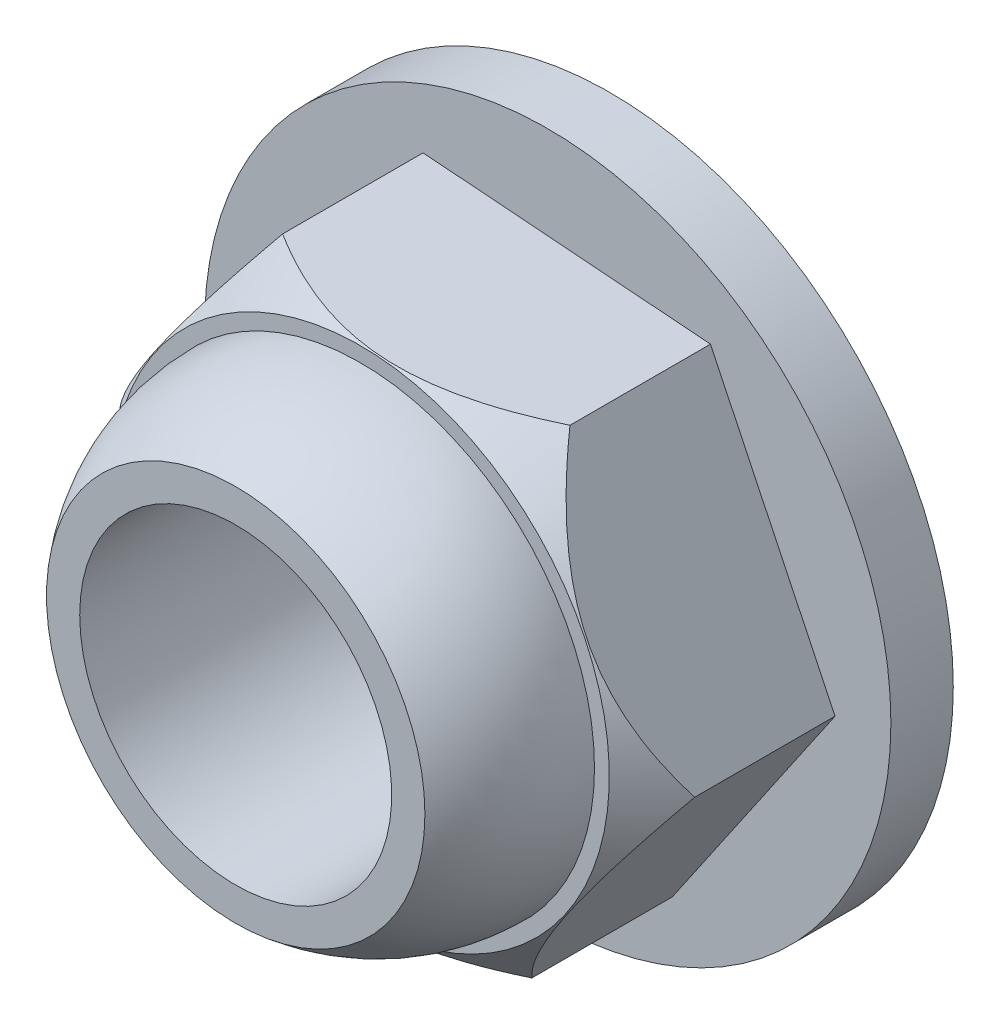
ISO-10303-21;
HEADER;
FILE_DESCRIPTION(('STEP AP214'),'2;1');
FILE_NAME('part.step','',(''),(''),'','','');
FILE_SCHEMA(('AUTOMOTIVE_DESIGN { 1 0 10303 214 1 1 1 1 }'));
ENDSEC;
DATA;
#1=APPLICATION_CONTEXT('core data for automotive mechanical design processes');
#2=APPLICATION_PROTOCOL_DEFINITION('international standard','automotive_design',2000,#1);
#3=PRODUCT_CONTEXT('',#1,'mechanical');
#4=PRODUCT('Part','Part','',(#3));
#5=PRODUCT_RELATED_PRODUCT_CATEGORY('part','',(#4));
#6=PRODUCT_DEFINITION_FORMATION('','',#4);
#7=PRODUCT_DEFINITION_CONTEXT('part definition',#1,'design');
#8=PRODUCT_DEFINITION('design','',#6,#7);
#9=PRODUCT_DEFINITION_SHAPE('','',#8);
#10=(LENGTH_UNIT() NAMED_UNIT(*) SI_UNIT(.MILLI.,.METRE.));
#11=(NAMED_UNIT(*) PLANE_ANGLE_UNIT() SI_UNIT($,.RADIAN.));
#12=(NAMED_UNIT(*) SI_UNIT($,.STERADIAN.) SOLID_ANGLE_UNIT());
#13=UNCERTAINTY_MEASURE_WITH_UNIT(LENGTH_MEASURE(1.E-05),#10,'distance_accuracy_value','');
#14=(GEOMETRIC_REPRESENTATION_CONTEXT(3) GLOBAL_UNCERTAINTY_ASSIGNED_CONTEXT((#13)) GLOBAL_UNIT_ASSIGNED_CONTEXT((#10,
#11,#12)) REPRESENTATION_CONTEXT('',''));
#15=CARTESIAN_POINT('',(0.,0.,0.));
#16=DIRECTION('',(0.,0.,1.));
#17=DIRECTION('',(1.,0.,0.));
#18=AXIS2_PLACEMENT_3D('',#15,#16,#17);
#19=CARTESIAN_POINT('',(0.,0.,1.));
#20=DIRECTION('',(0.,0.,-1.));
#21=DIRECTION('',(-1.,0.,0.));
#22=AXIS2_PLACEMENT_3D('',#19,#20,#21);
#23=CYLINDRICAL_SURFACE('',#22,5.5);
#24=CARTESIAN_POINT('',(0.,0.,1.));
#25=DIRECTION('',(0.,0.,1.));
#26=DIRECTION('',(1.,0.,0.));
#27=AXIS2_PLACEMENT_3D('',#24,#25,#26);
#28=CIRCLE('',#27,5.5);
#29=CARTESIAN_POINT('',(5.5,0.,1.));
#30=VERTEX_POINT('',#29);
#31=EDGE_CURVE('E129',#30,#30,#28,.T.);
#32=ORIENTED_EDGE('',*,*,#31,.F.);
#33=EDGE_LOOP('',(#32));
#34=FACE_BOUND('',#33,.T.);
#35=CARTESIAN_POINT('',(0.,0.,0.));
#36=DIRECTION('',(0.,0.,1.));
#37=DIRECTION('',(1.,0.,0.));
#38=AXIS2_PLACEMENT_3D('',#35,#36,#37);
#39=CIRCLE('',#38,5.5);
#40=CARTESIAN_POINT('',(5.5,0.,0.));
#41=VERTEX_POINT('',#40);
#42=EDGE_CURVE('E128',#41,#41,#39,.T.);
#43=ORIENTED_EDGE('',*,*,#42,.T.);
#44=EDGE_LOOP('',(#43));
#45=FACE_BOUND('',#44,.T.);
#46=ADVANCED_FACE('F43',(#34,#45),#23,.T.);
#47=CARTESIAN_POINT('',(0.,0.,1.));
#48=DIRECTION('',(0.,0.,1.));
#49=DIRECTION('',(1.,0.,0.));
#50=AXIS2_PLACEMENT_3D('',#47,#48,#49);
#51=PLANE('',#50);
#52=DIRECTION('',(-0.432395096374126,0.901684246636044,0.));
#53=VECTOR('',#52,1.);
#54=CARTESIAN_POINT('',(4.60531068769568,-0.352770184580956,1.));
#55=LINE('',#54,#53);
#56=CARTESIAN_POINT('',(4.60531068769568,-0.352770184580956,1.));
#57=VERTEX_POINT('',#56);
#58=CARTESIAN_POINT('',(2.60816328539267,3.81193095557396,1.));
#59=VERTEX_POINT('',#58);
#60=EDGE_CURVE('E370',#57,#59,#55,.T.);
#61=ORIENTED_EDGE('',*,*,#60,.F.);
#62=DIRECTION('',(0.564683915591984,0.825307261249836,0.));
#63=VECTOR('',#62,1.);
#64=CARTESIAN_POINT('',(1.99714740230301,-4.16470114015492,1.));
#65=LINE('',#64,#63);
#66=CARTESIAN_POINT('',(1.99714740230301,-4.16470114015492,1.));
#67=VERTEX_POINT('',#66);
#68=EDGE_CURVE('E358',#67,#57,#65,.T.);
#69=ORIENTED_EDGE('',*,*,#68,.F.);
#70=DIRECTION('',(0.99707901196611,-0.0763769853862086,0.));
#71=VECTOR('',#70,1.);
#72=CARTESIAN_POINT('',(-2.60816328539267,-3.81193095557396,1.));
#73=LINE('',#72,#71);
#74=CARTESIAN_POINT('',(-2.60816328539267,-3.81193095557396,1.));
#75=VERTEX_POINT('',#74);
#76=EDGE_CURVE('E360',#75,#67,#73,.T.);
#77=ORIENTED_EDGE('',*,*,#76,.F.);
#78=DIRECTION('',(0.432395096374126,-0.901684246636044,0.));
#79=VECTOR('',#78,1.);
#80=CARTESIAN_POINT('',(-4.60531068769568,0.352770184580956,1.));
#81=LINE('',#80,#79);
#82=CARTESIAN_POINT('',(-4.60531068769568,0.352770184580956,1.));
#83=VERTEX_POINT('',#82);
#84=EDGE_CURVE('E365',#83,#75,#81,.T.);
#85=ORIENTED_EDGE('',*,*,#84,.F.);
#86=DIRECTION('',(-0.564683915591984,-0.825307261249836,0.));
#87=VECTOR('',#86,1.);
#88=CARTESIAN_POINT('',(-1.99714740230301,4.16470114015492,1.));
#89=LINE('',#88,#87);
#90=CARTESIAN_POINT('',(-1.99714740230301,4.16470114015492,1.));
#91=VERTEX_POINT('',#90);
#92=EDGE_CURVE('E118',#91,#83,#89,.T.);
#93=ORIENTED_EDGE('',*,*,#92,.F.);
#94=DIRECTION('',(-0.99707901196611,0.0763769853862088,0.));
#95=VECTOR('',#94,1.);
#96=CARTESIAN_POINT('',(2.60816328539267,3.81193095557396,1.));
#97=LINE('',#96,#95);
#98=EDGE_CURVE('E368',#59,#91,#97,.T.);
#99=ORIENTED_EDGE('',*,*,#98,.F.);
#100=EDGE_LOOP('',(#61,#69,#77,#85,#93,#99));
#101=FACE_BOUND('',#100,.T.);
#102=ORIENTED_EDGE('',*,*,#31,.T.);
#103=EDGE_LOOP('',(#102));
#104=FACE_BOUND('',#103,.T.);
#105=ADVANCED_FACE('F210',(#101,#104),#51,.T.);
#106=CARTESIAN_POINT('',(0.,0.,0.));
#107=DIRECTION('',(0.,0.,1.));
#108=DIRECTION('',(1.,0.,0.));
#109=AXIS2_PLACEMENT_3D('',#106,#107,#108);
#110=PLANE('',#109);
#111=CARTESIAN_POINT('',(0.,0.,0.));
#112=DIRECTION('',(0.,0.,1.));
#113=DIRECTION('',(1.,0.,0.));
#114=AXIS2_PLACEMENT_3D('',#111,#112,#113);
#115=CIRCLE('',#114,2.8);
#116=CARTESIAN_POINT('',(2.8,0.,0.));
#117=VERTEX_POINT('',#116);
#118=EDGE_CURVE('E11',#117,#117,#115,.T.);
#119=ORIENTED_EDGE('',*,*,#118,.T.);
#120=EDGE_LOOP('',(#119));
#121=FACE_BOUND('',#120,.T.);
#122=ORIENTED_EDGE('',*,*,#42,.F.);
#123=EDGE_LOOP('',(#122));
#124=FACE_BOUND('',#123,.T.);
#125=ADVANCED_FACE('F209',(#121,#124),#110,.F.);
#126=CARTESIAN_POINT('',(4.60531068769568,-0.352770184580956,4.));
#127=DIRECTION('',(-0.901684246636044,-0.432395096374126,0.));
#128=DIRECTION('',(0.432395096374126,-0.901684246636044,0.));
#129=AXIS2_PLACEMENT_3D('',#126,#127,#128);
#130=PLANE('',#129);
#131=DIRECTION('',(0.,0.,-1.));
#132=VECTOR('',#131,1.);
#133=CARTESIAN_POINT('',(2.60816328539267,3.81193095557396,4.));
#134=LINE('',#133,#132);
#135=CARTESIAN_POINT('',(2.60816328539268,3.81193095557396,3.25149245370176));
#136=VERTEX_POINT('',#135);
#137=EDGE_CURVE('E121',#136,#59,#134,.T.);
#138=ORIENTED_EDGE('',*,*,#137,.F.);
#139=CARTESIAN_POINT('',(2.60806737707488,3.81213095557396,3.25136093476338));
#140=CARTESIAN_POINT('',(2.63761713338248,3.75051011394572,3.29187772462482));
#141=CARTESIAN_POINT('',(2.66741991488422,3.6883616325883,3.33140533351202));
#142=CARTESIAN_POINT('',(2.72758551170892,3.56289681741992,3.40818781262446));
#143=CARTESIAN_POINT('',(2.75794858602765,3.49957994351868,3.44544159566672));
#144=CARTESIAN_POINT('',(2.85028564663545,3.30702717493063,3.55372615758536));
#145=CARTESIAN_POINT('',(2.91315285453046,3.17592862301765,3.62078481710316));
#146=CARTESIAN_POINT('',(3.04152693914013,2.90822695216264,3.74118892313267));
#147=CARTESIAN_POINT('',(3.1070403286602,2.77161025190556,3.79449780762944));
#148=CARTESIAN_POINT('',(3.24018789367677,2.49395432365815,3.88315457215428));
#149=CARTESIAN_POINT('',(3.30781582522003,2.35292811633877,3.91855084551563));
#150=CARTESIAN_POINT('',(3.41986021543304,2.11927916327202,3.95917286876654));
#151=CARTESIAN_POINT('',(3.46385899475164,2.02752741466182,3.97067434090142));
#152=CARTESIAN_POINT('',(3.55214171338948,1.84342926620117,3.98446902697901));
#153=CARTESIAN_POINT('',(3.59642570085639,1.75108276594717,3.98676064304945));
#154=CARTESIAN_POINT('',(3.6846638552696,1.5670775483723,3.98201632275763));
#155=CARTESIAN_POINT('',(3.72861852867291,1.47541777492402,3.97502960089012));
#156=CARTESIAN_POINT('',(3.81608785019661,1.29301582369186,3.95216656350718));
#157=CARTESIAN_POINT('',(3.85960247586801,1.20227369272138,3.93628979677334));
#158=CARTESIAN_POINT('',(3.95819416594263,0.996677989775243,3.89067263470928));
#159=CARTESIAN_POINT('',(4.0130412231714,0.882304057479912,3.85827404592704));
#160=CARTESIAN_POINT('',(4.12121878988991,0.65671868760074,3.78197083877144));
#161=CARTESIAN_POINT('',(4.17454843449398,0.545509053584475,3.73805979867467));
#162=CARTESIAN_POINT('',(4.2797593962661,0.326110018769196,3.64065145766089));
#163=CARTESIAN_POINT('',(4.33163440462717,0.21793377388223,3.58711818802169));
#164=CARTESIAN_POINT('',(4.43375911132565,0.00497058351645422,3.4724740916542));
#165=CARTESIAN_POINT('',(4.48400937032254,-0.0998175311195037,3.41136591479039));
#166=CARTESIAN_POINT('',(4.5455983525099,-0.228250567179283,3.33158804618438));
#167=CARTESIAN_POINT('',(4.55763799170141,-0.253357126169429,3.31575549434516));
#168=CARTESIAN_POINT('',(4.58160075445412,-0.303327271208477,3.28378907039024));
#169=CARTESIAN_POINT('',(4.59352409893298,-0.328191317942488,3.26765608423025));
#170=CARTESIAN_POINT('',(4.60540659601347,-0.352970184580956,3.25136093476338));
#171=B_SPLINE_CURVE_WITH_KNOTS('',3,(#139,#140,#141,#142,#143,#144,#145,#146,#147,#148,#149,
#150,#151,#152,#153,#154,#155,#156,#157,#158,#159,#160,#161,#162,#163,#164,#165,#166,#167,#168,
#169,#170),.UNSPECIFIED.,.F.,.F.,(4,2,2,2,2,2,2,2,2,2,2,2,2,2,2,4),(0.,0.238326652345277,
0.476766377155824,0.956513981659734,1.43752442832955,1.91722832850656,2.2240652318524,
2.53095536784607,2.83622417044703,3.14150846851424,3.53358680767204,3.92588431782904,
4.31967997927586,4.71333826930106,4.80942941627643,4.90527185518117),.UNSPECIFIED.);
#172=CARTESIAN_POINT('',(4.60531068769568,-0.352770184580957,3.25149245370176));
#173=VERTEX_POINT('',#172);
#174=EDGE_CURVE('E193',#136,#173,#171,.T.);
#175=ORIENTED_EDGE('',*,*,#174,.T.);
#176=DIRECTION('',(0.,0.,-1.));
#177=VECTOR('',#176,1.);
#178=CARTESIAN_POINT('',(4.60531068769568,-0.352770184580956,4.));
#179=LINE('',#178,#177);
#180=EDGE_CURVE('E67',#173,#57,#179,.T.);
#181=ORIENTED_EDGE('',*,*,#180,.T.);
#182=ORIENTED_EDGE('',*,*,#60,.T.);
#183=EDGE_LOOP('',(#138,#175,#181,#182));
#184=FACE_BOUND('',#183,.T.);
#185=ADVANCED_FACE('F203',(#184),#130,.F.);
#186=CARTESIAN_POINT('',(2.60816328539267,3.81193095557396,4.));
#187=DIRECTION('',(-0.0763769853862088,-0.99707901196611,0.));
#188=DIRECTION('',(0.99707901196611,-0.0763769853862088,0.));
#189=AXIS2_PLACEMENT_3D('',#186,#187,#188);
#190=PLANE('',#189);
#191=DIRECTION('',(0.,0.,-1.));
#192=VECTOR('',#191,1.);
#193=CARTESIAN_POINT('',(-1.99714740230301,4.16470114015492,4.));
#194=LINE('',#193,#192);
#195=CARTESIAN_POINT('',(-1.997147402303,4.16470114015492,3.25149245370176));
#196=VERTEX_POINT('',#195);
#197=EDGE_CURVE('E119',#196,#91,#194,.T.);
#198=ORIENTED_EDGE('',*,*,#197,.F.);
#199=CARTESIAN_POINT('',(-1.99734740230301,4.16471646030196,3.25137351814616));
#200=CARTESIAN_POINT('',(-1.92920790809993,4.15949692494868,3.29188967325034));
#201=CARTESIAN_POINT('',(-1.86048495990435,4.15423269659061,3.33141665412486));
#202=CARTESIAN_POINT('',(-1.72174767720442,4.14360531873376,3.40819789598988));
#203=CARTESIAN_POINT('',(-1.6517327454886,4.13824212348815,3.44545106982289));
#204=CARTESIAN_POINT('',(-1.43881057329969,4.12193212855445,3.55373382249794));
#205=CARTESIAN_POINT('',(-1.29384365019516,4.11082755566247,3.62079132228933));
#206=CARTESIAN_POINT('',(-0.997823033855816,4.08815215881144,3.74119328003099));
#207=CARTESIAN_POINT('',(-0.8467543239842,4.07658018456696,3.79450117938465));
#208=CARTESIAN_POINT('',(-0.539726615054441,4.0530616363309,3.88315629599833));
#209=CARTESIAN_POINT('',(-0.383782013401316,4.04111616519112,3.91855190432397));
#210=CARTESIAN_POINT('',(-0.12541564093232,4.02132511110461,3.95917335836369));
#211=CARTESIAN_POINT('',(-0.0239569754431009,4.01355330273398,3.97067470849011));
#212=CARTESIAN_POINT('',(0.179617906960415,3.99795931707012,3.98446916099109));
#213=CARTESIAN_POINT('',(0.281734234895488,3.99013713127262,3.98676066554034));
#214=CARTESIAN_POINT('',(0.485206349817099,3.97455101767343,3.98201613912634));
#215=CARTESIAN_POINT('',(0.586563304680283,3.96678700041154,3.97502932115002));
#216=CARTESIAN_POINT('',(0.788262534231914,3.95133669113515,3.9521661092569));
#217=CARTESIAN_POINT('',(0.888604757152604,3.9436504030861,3.93628926411078));
#218=CARTESIAN_POINT('',(1.11595175033419,3.92623545625898,3.89067189811289));
#219=CARTESIAN_POINT('',(1.24242613094637,3.91654742571795,3.8582731653888));
#220=CARTESIAN_POINT('',(1.49187780511139,3.89743924407575,3.78196966231368));
#221=CARTESIAN_POINT('',(1.6148531042635,3.88801924574715,3.73805847018565));
#222=CARTESIAN_POINT('',(1.85746390320182,3.86943508017685,3.64064983416934));
#223=CARTESIAN_POINT('',(1.97708485607294,3.86027202723955,3.58711642372545));
#224=CARTESIAN_POINT('',(2.21257888229619,3.8422330116916,3.47247205066079));
#225=CARTESIAN_POINT('',(2.32845324853707,3.83335695004472,3.41136373798059));
#226=CARTESIAN_POINT('',(2.4704697933594,3.82247837829833,3.33158811976058));
#227=CARTESIAN_POINT('',(2.49822827874387,3.82035205790936,3.31575800645049));
#228=CARTESIAN_POINT('',(2.55347665296271,3.81611999182465,3.28379654982668));
#229=CARTESIAN_POINT('',(2.58096705098669,3.8140142071246,3.26766609206388));
#230=CARTESIAN_POINT('',(2.60836328539267,3.81191563542692,3.25137351814616));
#231=B_SPLINE_CURVE_WITH_KNOTS('',3,(#199,#200,#201,#202,#203,#204,#205,#206,#207,#208,#209,
#210,#211,#212,#213,#214,#215,#216,#217,#218,#219,#220,#221,#222,#223,#224,#225,#226,#227,#228,
#229,#230),.UNSPECIFIED.,.F.,.F.,(4,2,2,2,2,2,2,2,2,2,2,2,2,2,2,4),(0.,0.238324133149708,
0.47676133587326,0.95650378403216,1.43750895983803,1.91720764155606,2.22404429649647,
2.53093418253723,2.83620278339812,3.14148688012074,3.53356567814473,3.92586364910339,
4.31965968279515,4.71331834091235,4.80939475105806,4.90522253009002),.UNSPECIFIED.);
#232=EDGE_CURVE('E102',#196,#136,#231,.T.);
#233=ORIENTED_EDGE('',*,*,#232,.T.);
#234=ORIENTED_EDGE('',*,*,#137,.T.);
#235=ORIENTED_EDGE('',*,*,#98,.T.);
#236=EDGE_LOOP('',(#198,#233,#234,#235));
#237=FACE_BOUND('',#236,.T.);
#238=ADVANCED_FACE('F200',(#237),#190,.F.);
#239=CARTESIAN_POINT('',(-1.99714740230301,4.16470114015492,4.));
#240=DIRECTION('',(0.825307261249836,-0.564683915591984,0.));
#241=DIRECTION('',(0.564683915591984,0.825307261249836,0.));
#242=AXIS2_PLACEMENT_3D('',#239,#240,#241);
#243=PLANE('',#242);
#244=DIRECTION('',(0.,0.,-1.));
#245=VECTOR('',#244,1.);
#246=CARTESIAN_POINT('',(-4.60531068769568,0.352770184580956,4.));
#247=LINE('',#246,#245);
#248=CARTESIAN_POINT('',(-4.60531068769568,0.35277018458096,3.25149245370176));
#249=VERTEX_POINT('',#248);
#250=EDGE_CURVE('E111',#249,#83,#247,.T.);
#251=ORIENTED_EDGE('',*,*,#250,.F.);
#252=CARTESIAN_POINT('',(-4.60544752980094,0.352570184580956,3.25134876303566));
#253=CARTESIAN_POINT('',(-4.56685686599654,0.408971923987385,3.29186616689321));
#254=CARTESIAN_POINT('',(-4.52793576098946,0.465856615920813,3.33139438325245));
#255=CARTESIAN_POINT('',(-4.44936216676606,0.580694945939627,3.40817805914504));
#256=CARTESIAN_POINT('',(-4.40970933930568,0.63864907838172,3.44543243147076));
#257=CARTESIAN_POINT('',(-4.2891212136904,0.814893261973289,3.55371874345709));
#258=CARTESIAN_POINT('',(-4.20701939778567,0.934888223680212,3.62077852476913));
#259=CARTESIAN_POINT('',(-4.03936841830982,1.17991657829876,3.74118470881806));
#260=CARTESIAN_POINT('',(-3.95381074853954,1.30496240334763,3.79449454623354));
#261=CARTESIAN_POINT('',(-3.7799257120521,1.55910207206005,3.8831529047601));
#262=CARTESIAN_POINT('',(-3.69160650003026,1.68818399732275,3.91854982139803));
#263=CARTESIAN_POINT('',(-3.54528180667714,1.90204316453115,3.95917239522253));
#264=CARTESIAN_POINT('',(-3.48782181322843,1.98602315495619,3.97067398536549));
#265=CARTESIAN_POINT('',(-3.37252941686619,2.15452742656254,3.98446889735968));
#266=CARTESIAN_POINT('',(-3.31469695107171,2.23905179964679,3.98676062129318));
#267=CARTESIAN_POINT('',(-3.19946275044253,2.40747101595097,3.98201650036048));
#268=CARTESIAN_POINT('',(-3.14206035421138,2.49136682582727,3.97502987144748));
#269=CARTESIAN_POINT('',(-3.02783020677022,2.65831857977973,3.95216700284549));
#270=CARTESIAN_POINT('',(-2.9710024848764,2.74137448100917,3.93629031194865));
#271=CARTESIAN_POINT('',(-2.84224725370729,2.9295552034871,3.89067334712078));
#272=CARTESIAN_POINT('',(-2.77062011775339,3.03424101757357,3.85827489755395));
#273=CARTESIAN_POINT('',(-2.62934636592698,3.24071803947372,3.78197197660083));
#274=CARTESIAN_POINT('',(-2.55970087953462,3.34250759650871,3.73806108354293));
#275=CARTESIAN_POINT('',(-2.42230132147944,3.54332233520474,3.6406530278432));
#276=CARTESIAN_POINT('',(-2.35455548922865,3.6423354746482,3.58711989438352));
#277=CARTESIAN_POINT('',(-2.22118638630015,3.83725954815909,3.47247606562367));
#278=CARTESIAN_POINT('',(-2.15556238345385,3.93317155231906,3.41136802011436));
#279=CARTESIAN_POINT('',(-2.07512829191733,4.0507290707186,3.33158797478352));
#280=CARTESIAN_POINT('',(-2.05940286433909,4.07371238794833,3.31575306424287));
#281=CARTESIAN_POINT('',(-2.02810421703556,4.11945656477656,3.28378183555542));
#282=CARTESIAN_POINT('',(-2.01253070867576,4.14221784622551,3.26764640375599));
#283=CARTESIAN_POINT('',(-1.99701056019774,4.16490114015492,3.25134876303565));
#284=B_SPLINE_CURVE_WITH_KNOTS('',3,(#252,#253,#254,#255,#256,#257,#258,#259,#260,#261,#262,
#263,#264,#265,#266,#267,#268,#269,#270,#271,#272,#273,#274,#275,#276,#277,#278,#279,#280,#281,
#282,#283),.UNSPECIFIED.,.F.,.F.,(4,2,2,2,2,2,2,2,2,2,2,2,2,2,2,4),(0.,0.238329089151054,
0.476771253564285,0.956523845778741,1.43753939092988,1.91724833889577,2.22408548252941,
2.53097586030783,2.83624485805883,3.14152935089354,3.53360724625776,3.92590431074917,
4.31969961218734,4.71335754622074,4.80946294757136,4.90531956640235),.UNSPECIFIED.);
#285=EDGE_CURVE('E97',#249,#196,#284,.T.);
#286=ORIENTED_EDGE('',*,*,#285,.T.);
#287=ORIENTED_EDGE('',*,*,#197,.T.);
#288=ORIENTED_EDGE('',*,*,#92,.T.);
#289=EDGE_LOOP('',(#251,#286,#287,#288));
#290=FACE_BOUND('',#289,.T.);
#291=ADVANCED_FACE('F116',(#290),#243,.F.);
#292=CARTESIAN_POINT('',(-4.60531068769568,0.352770184580956,4.));
#293=DIRECTION('',(0.901684246636044,0.432395096374126,0.));
#294=DIRECTION('',(-0.432395096374126,0.901684246636044,0.));
#295=AXIS2_PLACEMENT_3D('',#292,#293,#294);
#296=PLANE('',#295);
#297=DIRECTION('',(0.,0.,-1.));
#298=VECTOR('',#297,1.);
#299=CARTESIAN_POINT('',(-2.60816328539267,-3.81193095557396,4.));
#300=LINE('',#299,#298);
#301=CARTESIAN_POINT('',(-2.60816328539267,-3.81193095557396,3.25149245370176));
#302=VERTEX_POINT('',#301);
#303=EDGE_CURVE('E113',#302,#75,#300,.T.);
#304=ORIENTED_EDGE('',*,*,#303,.F.);
#305=CARTESIAN_POINT('',(-2.60806737707488,-3.81213095557396,3.25136093476338));
#306=CARTESIAN_POINT('',(-2.63761713338248,-3.75051011394572,3.29187772462482));
#307=CARTESIAN_POINT('',(-2.66741991488421,-3.6883616325883,3.33140533351202));
#308=CARTESIAN_POINT('',(-2.72758551170892,-3.56289681741992,3.40818781262446));
#309=CARTESIAN_POINT('',(-2.75794858602765,-3.49957994351868,3.44544159566672));
#310=CARTESIAN_POINT('',(-2.85028564663545,-3.30702717493063,3.55372615758536));
#311=CARTESIAN_POINT('',(-2.91315285453046,-3.17592862301765,3.62078481710316));
#312=CARTESIAN_POINT('',(-3.04152693914013,-2.90822695216264,3.74118892313267));
#313=CARTESIAN_POINT('',(-3.1070403286602,-2.77161025190556,3.79449780762944));
#314=CARTESIAN_POINT('',(-3.24018789367676,-2.49395432365815,3.88315457215428));
#315=CARTESIAN_POINT('',(-3.30781582522003,-2.35292811633877,3.91855084551563));
#316=CARTESIAN_POINT('',(-3.41986021543304,-2.11927916327202,3.95917286876654));
#317=CARTESIAN_POINT('',(-3.46385899475164,-2.02752741466182,3.97067434090142));
#318=CARTESIAN_POINT('',(-3.55214171338948,-1.84342926620116,3.98446902697902));
#319=CARTESIAN_POINT('',(-3.59642570085639,-1.75108276594717,3.98676064304946));
#320=CARTESIAN_POINT('',(-3.6846638552696,-1.5670775483723,3.98201632275763));
#321=CARTESIAN_POINT('',(-3.72861852867291,-1.47541777492401,3.97502960089012));
#322=CARTESIAN_POINT('',(-3.81608785019661,-1.29301582369186,3.95216656350718));
#323=CARTESIAN_POINT('',(-3.85960247586801,-1.20227369272138,3.93628979677335));
#324=CARTESIAN_POINT('',(-3.95819416594263,-0.996677989775241,3.89067263470928));
#325=CARTESIAN_POINT('',(-4.0130412231714,-0.882304057479909,3.85827404592704));
#326=CARTESIAN_POINT('',(-4.1212187898899,-0.656718687600738,3.78197083877144));
#327=CARTESIAN_POINT('',(-4.17454843449398,-0.545509053584472,3.73805979867467));
#328=CARTESIAN_POINT('',(-4.2797593962661,-0.326110018769194,3.64065145766089));
#329=CARTESIAN_POINT('',(-4.33163440462717,-0.217933773882228,3.58711818802169));
#330=CARTESIAN_POINT('',(-4.43375911132565,-0.00497058351645224,3.4724740916542));
#331=CARTESIAN_POINT('',(-4.48400937032254,0.0998175311195057,3.41136591479039));
#332=CARTESIAN_POINT('',(-4.5455983525099,0.228250567179285,3.33158804618438));
#333=CARTESIAN_POINT('',(-4.55763799170141,0.25335712616943,3.31575549434516));
#334=CARTESIAN_POINT('',(-4.58160075445411,0.303327271208478,3.28378907039024));
#335=CARTESIAN_POINT('',(-4.59352409893297,0.328191317942489,3.26765608423025));
#336=CARTESIAN_POINT('',(-4.60540659601347,0.352970184580956,3.25136093476338));
#337=B_SPLINE_CURVE_WITH_KNOTS('',3,(#305,#306,#307,#308,#309,#310,#311,#312,#313,#314,#315,
#316,#317,#318,#319,#320,#321,#322,#323,#324,#325,#326,#327,#328,#329,#330,#331,#332,#333,#334,
#335,#336),.UNSPECIFIED.,.F.,.F.,(4,2,2,2,2,2,2,2,2,2,2,2,2,2,2,4),(0.,0.238326652345278,
0.476766377155826,0.956513981659736,1.43752442832956,1.91722832850656,2.22406523185241,
2.53095536784608,2.83622417044703,3.14150846851424,3.53358680767204,3.92588431782904,
4.31967997927587,4.71333826930107,4.80942941627643,4.90527185518117),.UNSPECIFIED.);
#338=EDGE_CURVE('E100',#302,#249,#337,.T.);
#339=ORIENTED_EDGE('',*,*,#338,.T.);
#340=ORIENTED_EDGE('',*,*,#250,.T.);
#341=ORIENTED_EDGE('',*,*,#84,.T.);
#342=EDGE_LOOP('',(#304,#339,#340,#341));
#343=FACE_BOUND('',#342,.T.);
#344=ADVANCED_FACE('F109',(#343),#296,.F.);
#345=CARTESIAN_POINT('',(-2.60816328539267,-3.81193095557396,4.));
#346=DIRECTION('',(0.0763769853862086,0.99707901196611,0.));
#347=DIRECTION('',(-0.99707901196611,0.0763769853862086,0.));
#348=AXIS2_PLACEMENT_3D('',#345,#346,#347);
#349=PLANE('',#348);
#350=DIRECTION('',(0.,0.,-1.));
#351=VECTOR('',#350,1.);
#352=CARTESIAN_POINT('',(1.99714740230301,-4.16470114015492,4.));
#353=LINE('',#352,#351);
#354=CARTESIAN_POINT('',(1.99714740230301,-4.16470114015492,3.25149245370176));
#355=VERTEX_POINT('',#354);
#356=EDGE_CURVE('E123',#355,#67,#353,.T.);
#357=ORIENTED_EDGE('',*,*,#356,.F.);
#358=CARTESIAN_POINT('',(1.99734740230301,-4.16471646030196,3.25137351814616));
#359=CARTESIAN_POINT('',(1.92920790809993,-4.15949692494868,3.29188967325034));
#360=CARTESIAN_POINT('',(1.86048495990435,-4.15423269659061,3.33141665412486));
#361=CARTESIAN_POINT('',(1.72174767720442,-4.14360531873376,3.40819789598988));
#362=CARTESIAN_POINT('',(1.6517327454886,-4.13824212348815,3.44545106982289));
#363=CARTESIAN_POINT('',(1.43881057329969,-4.12193212855445,3.55373382249794));
#364=CARTESIAN_POINT('',(1.29384365019516,-4.11082755566247,3.62079132228933));
#365=CARTESIAN_POINT('',(0.997823033855816,-4.08815215881144,3.74119328003099));
#366=CARTESIAN_POINT('',(0.8467543239842,-4.07658018456696,3.79450117938465));
#367=CARTESIAN_POINT('',(0.539726615054442,-4.0530616363309,3.88315629599833));
#368=CARTESIAN_POINT('',(0.383782013401317,-4.04111616519112,3.91855190432397));
#369=CARTESIAN_POINT('',(0.125415640932321,-4.02132511110461,3.95917335836368));
#370=CARTESIAN_POINT('',(0.0239569754431023,-4.01355330273398,3.97067470849011));
#371=CARTESIAN_POINT('',(-0.179617906960414,-3.99795931707012,3.98446916099109));
#372=CARTESIAN_POINT('',(-0.281734234895487,-3.99013713127262,3.98676066554034));
#373=CARTESIAN_POINT('',(-0.485206349817098,-3.97455101767343,3.98201613912633));
#374=CARTESIAN_POINT('',(-0.586563304680282,-3.96678700041154,3.97502932115002));
#375=CARTESIAN_POINT('',(-0.788262534231913,-3.95133669113515,3.9521661092569));
#376=CARTESIAN_POINT('',(-0.888604757152603,-3.9436504030861,3.93628926411078));
#377=CARTESIAN_POINT('',(-1.11595175033419,-3.92623545625898,3.89067189811289));
#378=CARTESIAN_POINT('',(-1.24242613094637,-3.91654742571795,3.8582731653888));
#379=CARTESIAN_POINT('',(-1.49187780511139,-3.89743924407576,3.78196966231368));
#380=CARTESIAN_POINT('',(-1.6148531042635,-3.88801924574715,3.73805847018565));
#381=CARTESIAN_POINT('',(-1.85746390320182,-3.86943508017685,3.64064983416934));
#382=CARTESIAN_POINT('',(-1.97708485607294,-3.86027202723955,3.58711642372545));
#383=CARTESIAN_POINT('',(-2.21257888229619,-3.8422330116916,3.47247205066079));
#384=CARTESIAN_POINT('',(-2.32845324853707,-3.83335695004472,3.41136373798059));
#385=CARTESIAN_POINT('',(-2.4704697933594,-3.82247837829833,3.33158811976059));
#386=CARTESIAN_POINT('',(-2.49822827874387,-3.82035205790937,3.3157580064505));
#387=CARTESIAN_POINT('',(-2.55347665296271,-3.81611999182465,3.28379654982668));
#388=CARTESIAN_POINT('',(-2.58096705098668,-3.8140142071246,3.26766609206388));
#389=CARTESIAN_POINT('',(-2.60836328539267,-3.81191563542692,3.25137351814616));
#390=B_SPLINE_CURVE_WITH_KNOTS('',3,(#358,#359,#360,#361,#362,#363,#364,#365,#366,#367,#368,
#369,#370,#371,#372,#373,#374,#375,#376,#377,#378,#379,#380,#381,#382,#383,#384,#385,#386,#387,
#388,#389),.UNSPECIFIED.,.F.,.F.,(4,2,2,2,2,2,2,2,2,2,2,2,2,2,2,4),(0.,0.238324133149708,
0.476761335873261,0.95650378403216,1.43750895983803,1.91720764155606,2.22404429649647,
2.53093418253723,2.83620278339812,3.14148688012074,3.53356567814473,3.92586364910339,
4.31965968279514,4.71331834091235,4.80939475105806,4.90522253009002),.UNSPECIFIED.);
#391=EDGE_CURVE('E59',#355,#302,#390,.T.);
#392=ORIENTED_EDGE('',*,*,#391,.T.);
#393=ORIENTED_EDGE('',*,*,#303,.T.);
#394=ORIENTED_EDGE('',*,*,#76,.T.);
#395=EDGE_LOOP('',(#357,#392,#393,#394));
#396=FACE_BOUND('',#395,.T.);
#397=ADVANCED_FACE('F254',(#396),#349,.F.);
#398=CARTESIAN_POINT('',(1.99714740230301,-4.16470114015492,4.));
#399=DIRECTION('',(-0.825307261249836,0.564683915591984,0.));
#400=DIRECTION('',(-0.564683915591984,-0.825307261249836,0.));
#401=AXIS2_PLACEMENT_3D('',#398,#399,#400);
#402=PLANE('',#401);
#403=ORIENTED_EDGE('',*,*,#180,.F.);
#404=CARTESIAN_POINT('',(4.60544752980094,-0.352570184580956,3.25134876303565));
#405=CARTESIAN_POINT('',(4.56685686599654,-0.408971923987385,3.29186616689321));
#406=CARTESIAN_POINT('',(4.52793576098946,-0.465856615920813,3.33139438325245));
#407=CARTESIAN_POINT('',(4.44936216676606,-0.580694945939627,3.40817805914504));
#408=CARTESIAN_POINT('',(4.40970933930569,-0.638649078381721,3.44543243147076));
#409=CARTESIAN_POINT('',(4.2891212136904,-0.81489326197329,3.55371874345708));
#410=CARTESIAN_POINT('',(4.20701939778567,-0.934888223680213,3.62077852476913));
#411=CARTESIAN_POINT('',(4.03936841830982,-1.17991657829876,3.74118470881806));
#412=CARTESIAN_POINT('',(3.95381074853954,-1.30496240334763,3.79449454623354));
#413=CARTESIAN_POINT('',(3.7799257120521,-1.55910207206005,3.8831529047601));
#414=CARTESIAN_POINT('',(3.69160650003026,-1.68818399732275,3.91854982139803));
#415=CARTESIAN_POINT('',(3.54528180667714,-1.90204316453115,3.95917239522253));
#416=CARTESIAN_POINT('',(3.48782181322843,-1.98602315495619,3.97067398536549));
#417=CARTESIAN_POINT('',(3.37252941686619,-2.15452742656254,3.98446889735968));
#418=CARTESIAN_POINT('',(3.31469695107171,-2.23905179964679,3.98676062129318));
#419=CARTESIAN_POINT('',(3.19946275044253,-2.40747101595097,3.98201650036048));
#420=CARTESIAN_POINT('',(3.14206035421138,-2.49136682582727,3.97502987144748));
#421=CARTESIAN_POINT('',(3.02783020677022,-2.65831857977973,3.95216700284549));
#422=CARTESIAN_POINT('',(2.9710024848764,-2.74137448100917,3.93629031194865));
#423=CARTESIAN_POINT('',(2.84224725370729,-2.9295552034871,3.89067334712078));
#424=CARTESIAN_POINT('',(2.77062011775339,-3.03424101757358,3.85827489755394));
#425=CARTESIAN_POINT('',(2.62934636592698,-3.24071803947372,3.78197197660083));
#426=CARTESIAN_POINT('',(2.55970087953462,-3.34250759650871,3.73806108354293));
#427=CARTESIAN_POINT('',(2.42230132147944,-3.54332233520474,3.64065302784319));
#428=CARTESIAN_POINT('',(2.35455548922865,-3.6423354746482,3.58711989438352));
#429=CARTESIAN_POINT('',(2.22118638630015,-3.83725954815909,3.47247606562367));
#430=CARTESIAN_POINT('',(2.15556238345385,-3.93317155231906,3.41136802011436));
#431=CARTESIAN_POINT('',(2.07512829191733,-4.0507290707186,3.33158797478352));
#432=CARTESIAN_POINT('',(2.05940286433909,-4.07371238794834,3.31575306424287));
#433=CARTESIAN_POINT('',(2.02810421703557,-4.11945656477656,3.28378183555542));
#434=CARTESIAN_POINT('',(2.01253070867576,-4.14221784622551,3.26764640375598));
#435=CARTESIAN_POINT('',(1.99701056019774,-4.16490114015492,3.25134876303565));
#436=B_SPLINE_CURVE_WITH_KNOTS('',3,(#404,#405,#406,#407,#408,#409,#410,#411,#412,#413,#414,
#415,#416,#417,#418,#419,#420,#421,#422,#423,#424,#425,#426,#427,#428,#429,#430,#431,#432,#433,
#434,#435),.UNSPECIFIED.,.F.,.F.,(4,2,2,2,2,2,2,2,2,2,2,2,2,2,2,4),(0.,0.238329089151054,
0.476771253564285,0.956523845778742,1.43753939092988,1.91724833889578,2.22408548252941,
2.53097586030783,2.83624485805883,3.14152935089355,3.53360724625776,3.92590431074917,
4.31969961218735,4.71335754622075,4.80946294757136,4.90531956640235),.UNSPECIFIED.);
#437=EDGE_CURVE('E148',#173,#355,#436,.T.);
#438=ORIENTED_EDGE('',*,*,#437,.T.);
#439=ORIENTED_EDGE('',*,*,#356,.T.);
#440=ORIENTED_EDGE('',*,*,#68,.T.);
#441=EDGE_LOOP('',(#403,#438,#439,#440));
#442=FACE_BOUND('',#441,.T.);
#443=ADVANCED_FACE('F161',(#442),#402,.F.);
#444=CARTESIAN_POINT('',(0.,0.,4.));
#445=DIRECTION('',(0.,0.,-1.));
#446=DIRECTION('',(-1.,0.,0.));
#447=AXIS2_PLACEMENT_3D('',#444,#445,#446);
#448=CONICAL_SURFACE('',#447,3.98759916308222,0.700581005474275);
#449=CARTESIAN_POINT('',(0.,0.,4.));
#450=DIRECTION('',(0.,0.,-1.));
#451=DIRECTION('',(-1.,0.,0.));
#452=AXIS2_PLACEMENT_3D('',#449,#450,#451);
#453=CIRCLE('',#452,3.98759916308222);
#454=CARTESIAN_POINT('',(-3.98759916308222,0.,4.));
#455=VERTEX_POINT('',#454);
#456=EDGE_CURVE('E145',#455,#455,#453,.T.);
#457=ORIENTED_EDGE('',*,*,#456,.T.);
#458=EDGE_LOOP('',(#457));
#459=FACE_BOUND('',#458,.T.);
#460=ORIENTED_EDGE('',*,*,#232,.F.);
#461=ORIENTED_EDGE('',*,*,#285,.F.);
#462=ORIENTED_EDGE('',*,*,#338,.F.);
#463=ORIENTED_EDGE('',*,*,#391,.F.);
#464=ORIENTED_EDGE('',*,*,#437,.F.);
#465=ORIENTED_EDGE('',*,*,#174,.F.);
#466=EDGE_LOOP('',(#460,#461,#462,#463,#464,#465));
#467=FACE_BOUND('',#466,.T.);
#468=ADVANCED_FACE('F99',(#459,#467),#448,.T.);
#469=CARTESIAN_POINT('',(0.,0.,4.));
#470=DIRECTION('',(0.,0.,1.));
#471=DIRECTION('',(1.,0.,0.));
#472=AXIS2_PLACEMENT_3D('',#469,#470,#471);
#473=PLANE('',#472);
#474=CARTESIAN_POINT('',(0.,0.,4.));
#475=DIRECTION('',(0.,0.,1.));
#476=DIRECTION('',(1.,0.,0.));
#477=AXIS2_PLACEMENT_3D('',#474,#475,#476);
#478=CIRCLE('',#477,3.75);
#479=CARTESIAN_POINT('',(3.75,0.,4.));
#480=VERTEX_POINT('',#479);
#481=EDGE_CURVE('E132',#480,#480,#478,.T.);
#482=ORIENTED_EDGE('',*,*,#481,.F.);
#483=EDGE_LOOP('',(#482));
#484=FACE_BOUND('',#483,.T.);
#485=ORIENTED_EDGE('',*,*,#456,.F.);
#486=EDGE_LOOP('',(#485));
#487=FACE_BOUND('',#486,.T.);
#488=ADVANCED_FACE('F167',(#484,#487),#473,.T.);
#489=CARTESIAN_POINT('',(0.,0.,4.));
#490=DIRECTION('',(0.,0.,1.));
#491=DIRECTION('',(1.,0.,0.));
#492=AXIS2_PLACEMENT_3D('',#489,#490,#491);
#493=DEGENERATE_TOROIDAL_SURFACE('',#492,0.604775622892463,3.14522437710754,.T.);
#494=CARTESIAN_POINT('',(0.,0.,6.));
#495=DIRECTION('',(0.,0.,1.));
#496=DIRECTION('',(1.,0.,0.));
#497=AXIS2_PLACEMENT_3D('',#494,#495,#496);
#498=CIRCLE('',#497,3.03220973782772);
#499=CARTESIAN_POINT('',(3.03220973782772,0.,6.));
#500=VERTEX_POINT('',#499);
#501=EDGE_CURVE('E143',#500,#500,#498,.T.);
#502=ORIENTED_EDGE('',*,*,#501,.F.);
#503=EDGE_LOOP('',(#502));
#504=FACE_BOUND('',#503,.T.);
#505=ORIENTED_EDGE('',*,*,#481,.T.);
#506=EDGE_LOOP('',(#505));
#507=FACE_BOUND('',#506,.T.);
#508=ADVANCED_FACE('F169',(#504,#507),#493,.T.);
#509=CARTESIAN_POINT('',(0.,0.,6.));
#510=DIRECTION('',(0.,0.,-1.));
#511=DIRECTION('',(-1.,0.,0.));
#512=AXIS2_PLACEMENT_3D('',#509,#510,#511);
#513=PLANE('',#512);
#514=CARTESIAN_POINT('',(0.,0.,6.));
#515=DIRECTION('',(0.,0.,-1.));
#516=DIRECTION('',(-1.,0.,0.));
#517=AXIS2_PLACEMENT_3D('',#514,#515,#516);
#518=CIRCLE('',#517,2.5);
#519=CARTESIAN_POINT('',(-2.5,0.,6.));
#520=VERTEX_POINT('',#519);
#521=EDGE_CURVE('E349',#520,#520,#518,.F.);
#522=ORIENTED_EDGE('',*,*,#521,.F.);
#523=EDGE_LOOP('',(#522));
#524=FACE_BOUND('',#523,.T.);
#525=ORIENTED_EDGE('',*,*,#501,.T.);
#526=EDGE_LOOP('',(#525));
#527=FACE_BOUND('',#526,.T.);
#528=ADVANCED_FACE('F282',(#524,#527),#513,.F.);
#529=CARTESIAN_POINT('',(0.,0.,6.001));
#530=DIRECTION('',(0.,0.,-1.));
#531=DIRECTION('',(-1.,0.,0.));
#532=AXIS2_PLACEMENT_3D('',#529,#530,#531);
#533=CYLINDRICAL_SURFACE('',#532,2.5);
#534=CARTESIAN_POINT('',(0.,0.,0.3));
#535=DIRECTION('',(0.,0.,1.));
#536=DIRECTION('',(1.,0.,0.));
#537=AXIS2_PLACEMENT_3D('',#534,#535,#536);
#538=CIRCLE('',#537,2.5);
#539=CARTESIAN_POINT('',(2.5,0.,0.3));
#540=VERTEX_POINT('',#539);
#541=EDGE_CURVE('E52',#540,#540,#538,.F.);
#542=ORIENTED_EDGE('',*,*,#541,.T.);
#543=EDGE_LOOP('',(#542));
#544=FACE_BOUND('',#543,.T.);
#545=ORIENTED_EDGE('',*,*,#521,.T.);
#546=EDGE_LOOP('',(#545));
#547=FACE_BOUND('',#546,.T.);
#548=ADVANCED_FACE('F289',(#544,#547),#533,.F.);
#549=CARTESIAN_POINT('',(0.,0.,0.3));
#550=DIRECTION('',(0.,0.,-1.));
#551=DIRECTION('',(-1.,0.,0.));
#552=AXIS2_PLACEMENT_3D('',#549,#550,#551);
#553=CONICAL_SURFACE('',#552,2.5,0.785398163397452);
#554=ORIENTED_EDGE('',*,*,#118,.F.);
#555=EDGE_LOOP('',(#554));
#556=FACE_BOUND('',#555,.T.);
#557=ORIENTED_EDGE('',*,*,#541,.F.);
#558=EDGE_LOOP('',(#557));
#559=FACE_BOUND('',#558,.T.);
#560=ADVANCED_FACE('F46',(#556,#559),#553,.F.);
#561=CLOSED_SHELL('',(#46,#105,#125,#185,#238,#291,#344,#397,#443,#468,#488,#508,#528,#548,#560));
#562=MANIFOLD_SOLID_BREP('B2',#561);
#563=ADVANCED_BREP_SHAPE_REPRESENTATION('',(#18,#562),#14);
#564=SHAPE_DEFINITION_REPRESENTATION(#9,#563);
ENDSEC;
END-ISO-10303-21;
